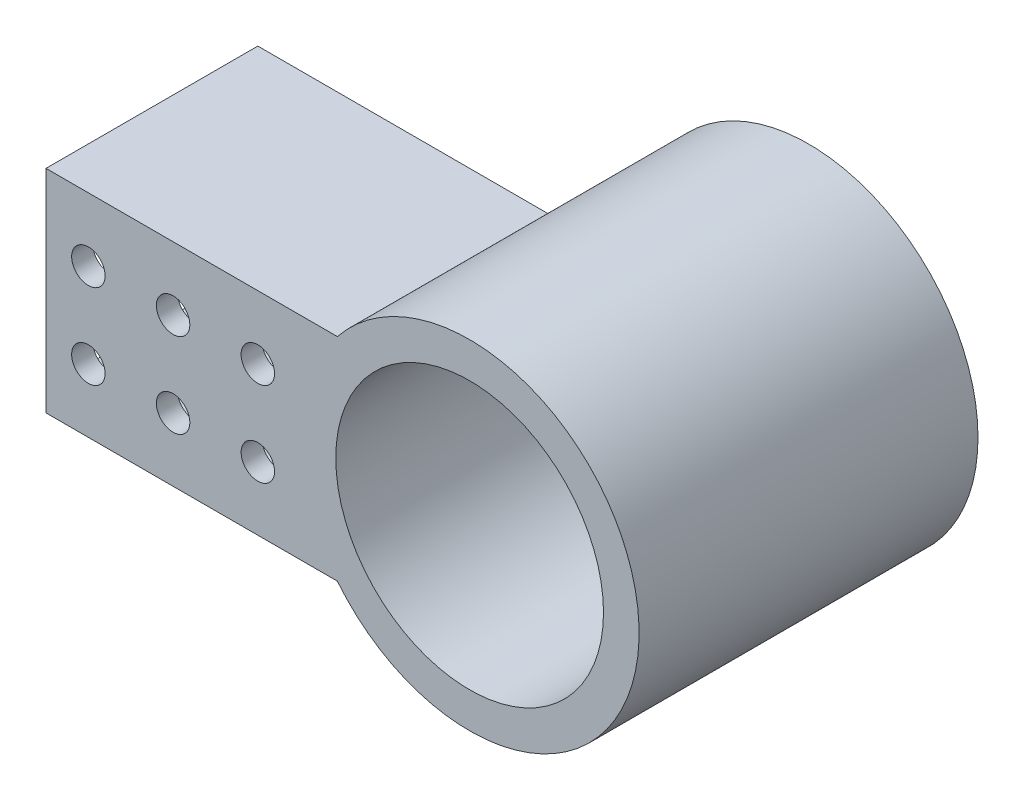
ISO-10303-21;
HEADER;
FILE_DESCRIPTION(('STEP AP214'),'2;1');
FILE_NAME('part.step','',(''),(''),'','','');
FILE_SCHEMA(('AUTOMOTIVE_DESIGN { 1 0 10303 214 1 1 1 1 }'));
ENDSEC;
DATA;
#1=APPLICATION_CONTEXT('core data for automotive mechanical design processes');
#2=APPLICATION_PROTOCOL_DEFINITION('international standard','automotive_design',2000,#1);
#3=PRODUCT_CONTEXT('',#1,'mechanical');
#4=PRODUCT('Part','Part','',(#3));
#5=PRODUCT_RELATED_PRODUCT_CATEGORY('part','',(#4));
#6=PRODUCT_DEFINITION_FORMATION('','',#4);
#7=PRODUCT_DEFINITION_CONTEXT('part definition',#1,'design');
#8=PRODUCT_DEFINITION('design','',#6,#7);
#9=PRODUCT_DEFINITION_SHAPE('','',#8);
#10=(LENGTH_UNIT() NAMED_UNIT(*) SI_UNIT(.MILLI.,.METRE.));
#11=(NAMED_UNIT(*) PLANE_ANGLE_UNIT() SI_UNIT($,.RADIAN.));
#12=(NAMED_UNIT(*) SI_UNIT($,.STERADIAN.) SOLID_ANGLE_UNIT());
#13=UNCERTAINTY_MEASURE_WITH_UNIT(LENGTH_MEASURE(1.E-05),#10,'distance_accuracy_value','');
#14=(GEOMETRIC_REPRESENTATION_CONTEXT(3) GLOBAL_UNCERTAINTY_ASSIGNED_CONTEXT((#13)) GLOBAL_UNIT_ASSIGNED_CONTEXT((#10,
#11,#12)) REPRESENTATION_CONTEXT('',''));
#15=CARTESIAN_POINT('',(0.,0.,0.));
#16=DIRECTION('',(0.,0.,1.));
#17=DIRECTION('',(1.,0.,0.));
#18=AXIS2_PLACEMENT_3D('',#15,#16,#17);
#19=CARTESIAN_POINT('',(-31.75,-6.35,19.05));
#20=DIRECTION('',(0.,0.,1.));
#21=DIRECTION('',(1.,0.,0.));
#22=AXIS2_PLACEMENT_3D('',#19,#20,#21);
#23=CYLINDRICAL_SURFACE('',#22,2.50825000000001);
#24=CARTESIAN_POINT('',(-31.75,-6.35,19.05));
#25=DIRECTION('',(0.,0.,1.));
#26=DIRECTION('',(1.,0.,0.));
#27=AXIS2_PLACEMENT_3D('',#24,#25,#26);
#28=CIRCLE('',#27,2.50825000000001);
#29=CARTESIAN_POINT('',(-29.24175,-6.35,19.05));
#30=VERTEX_POINT('',#29);
#31=EDGE_CURVE('E41',#30,#30,#28,.T.);
#32=ORIENTED_EDGE('',*,*,#31,.F.);
#33=EDGE_LOOP('',(#32));
#34=FACE_BOUND('',#33,.T.);
#35=CARTESIAN_POINT('',(-31.75,-6.35,22.225));
#36=DIRECTION('',(0.,0.,-1.));
#37=DIRECTION('',(-1.,0.,0.));
#38=AXIS2_PLACEMENT_3D('',#35,#36,#37);
#39=CIRCLE('',#38,2.50825000000001);
#40=CARTESIAN_POINT('',(-34.25825,-6.35,22.225));
#41=VERTEX_POINT('',#40);
#42=EDGE_CURVE('E11',#41,#41,#39,.T.);
#43=ORIENTED_EDGE('',*,*,#42,.F.);
#44=EDGE_LOOP('',(#43));
#45=FACE_BOUND('',#44,.T.);
#46=ADVANCED_FACE('F34',(#34,#45),#23,.F.);
#47=CARTESIAN_POINT('',(-31.75,6.35,19.05));
#48=DIRECTION('',(0.,0.,1.));
#49=DIRECTION('',(1.,0.,0.));
#50=AXIS2_PLACEMENT_3D('',#47,#48,#49);
#51=CYLINDRICAL_SURFACE('',#50,2.50825000000001);
#52=CARTESIAN_POINT('',(-31.75,6.35,50.8));
#53=DIRECTION('',(0.,0.,1.));
#54=DIRECTION('',(1.,0.,0.));
#55=AXIS2_PLACEMENT_3D('',#52,#53,#54);
#56=CIRCLE('',#55,2.50825000000001);
#57=CARTESIAN_POINT('',(-29.24175,6.35,50.8));
#58=VERTEX_POINT('',#57);
#59=EDGE_CURVE('E200',#58,#58,#56,.T.);
#60=ORIENTED_EDGE('',*,*,#59,.T.);
#61=EDGE_LOOP('',(#60));
#62=FACE_BOUND('',#61,.T.);
#63=CARTESIAN_POINT('',(-31.75,6.35,47.625));
#64=DIRECTION('',(0.,0.,1.));
#65=DIRECTION('',(0.,-1.,0.));
#66=AXIS2_PLACEMENT_3D('',#63,#64,#65);
#67=CIRCLE('',#66,2.50825000000001);
#68=CARTESIAN_POINT('',(-31.75,3.84175,47.625));
#69=VERTEX_POINT('',#68);
#70=EDGE_CURVE('E203',#69,#69,#67,.T.);
#71=ORIENTED_EDGE('',*,*,#70,.F.);
#72=EDGE_LOOP('',(#71));
#73=FACE_BOUND('',#72,.T.);
#74=ADVANCED_FACE('F212',(#62,#73),#51,.F.);
#75=CARTESIAN_POINT('',(-31.75,-6.35,19.05));
#76=DIRECTION('',(0.,0.,1.));
#77=DIRECTION('',(1.,0.,0.));
#78=AXIS2_PLACEMENT_3D('',#75,#76,#77);
#79=CYLINDRICAL_SURFACE('',#78,2.50825000000001);
#80=CARTESIAN_POINT('',(-31.75,-6.35,50.8));
#81=DIRECTION('',(0.,0.,1.));
#82=DIRECTION('',(1.,0.,0.));
#83=AXIS2_PLACEMENT_3D('',#80,#81,#82);
#84=CIRCLE('',#83,2.50825000000001);
#85=CARTESIAN_POINT('',(-29.24175,-6.35,50.8));
#86=VERTEX_POINT('',#85);
#87=EDGE_CURVE('E194',#86,#86,#84,.T.);
#88=ORIENTED_EDGE('',*,*,#87,.T.);
#89=EDGE_LOOP('',(#88));
#90=FACE_BOUND('',#89,.T.);
#91=CARTESIAN_POINT('',(-31.75,-6.35,47.625));
#92=DIRECTION('',(0.,0.,1.));
#93=DIRECTION('',(0.,-1.,0.));
#94=AXIS2_PLACEMENT_3D('',#91,#92,#93);
#95=CIRCLE('',#94,2.50825000000001);
#96=CARTESIAN_POINT('',(-31.75,-8.85825,47.625));
#97=VERTEX_POINT('',#96);
#98=EDGE_CURVE('E197',#97,#97,#95,.T.);
#99=ORIENTED_EDGE('',*,*,#98,.F.);
#100=EDGE_LOOP('',(#99));
#101=FACE_BOUND('',#100,.T.);
#102=ADVANCED_FACE('F264',(#90,#101),#79,.F.);
#103=CARTESIAN_POINT('',(-31.75,6.35,19.05));
#104=DIRECTION('',(0.,0.,1.));
#105=DIRECTION('',(1.,0.,0.));
#106=AXIS2_PLACEMENT_3D('',#103,#104,#105);
#107=CYLINDRICAL_SURFACE('',#106,2.50825000000001);
#108=CARTESIAN_POINT('',(-31.75,6.35,19.05));
#109=DIRECTION('',(0.,0.,1.));
#110=DIRECTION('',(1.,0.,0.));
#111=AXIS2_PLACEMENT_3D('',#108,#109,#110);
#112=CIRCLE('',#111,2.50825000000001);
#113=CARTESIAN_POINT('',(-29.24175,6.35,19.05));
#114=VERTEX_POINT('',#113);
#115=EDGE_CURVE('E178',#114,#114,#112,.T.);
#116=ORIENTED_EDGE('',*,*,#115,.F.);
#117=EDGE_LOOP('',(#116));
#118=FACE_BOUND('',#117,.T.);
#119=CARTESIAN_POINT('',(-31.75,6.35,22.225));
#120=DIRECTION('',(0.,0.,-1.));
#121=DIRECTION('',(-1.,0.,0.));
#122=AXIS2_PLACEMENT_3D('',#119,#120,#121);
#123=CIRCLE('',#122,2.50825000000001);
#124=CARTESIAN_POINT('',(-34.25825,6.35,22.225));
#125=VERTEX_POINT('',#124);
#126=EDGE_CURVE('E191',#125,#125,#123,.T.);
#127=ORIENTED_EDGE('',*,*,#126,.F.);
#128=EDGE_LOOP('',(#127));
#129=FACE_BOUND('',#128,.T.);
#130=ADVANCED_FACE('F254',(#118,#129),#107,.F.);
#131=CARTESIAN_POINT('',(0.,0.,50.8));
#132=DIRECTION('',(0.,0.,1.));
#133=DIRECTION('',(1.,0.,0.));
#134=AXIS2_PLACEMENT_3D('',#131,#132,#133);
#135=PLANE('',#134);
#136=CARTESIAN_POINT('',(-44.45,6.35,50.8));
#137=DIRECTION('',(0.,0.,1.));
#138=DIRECTION('',(1.,0.,0.));
#139=AXIS2_PLACEMENT_3D('',#136,#137,#138);
#140=CIRCLE('',#139,2.50825000000001);
#141=CARTESIAN_POINT('',(-41.94175,6.35,50.8));
#142=VERTEX_POINT('',#141);
#143=EDGE_CURVE('E319',#142,#142,#140,.T.);
#144=ORIENTED_EDGE('',*,*,#143,.F.);
#145=EDGE_LOOP('',(#144));
#146=FACE_BOUND('',#145,.T.);
#147=CARTESIAN_POINT('',(-44.45,-6.35,50.8));
#148=DIRECTION('',(0.,0.,1.));
#149=DIRECTION('',(1.,0.,0.));
#150=AXIS2_PLACEMENT_3D('',#147,#148,#149);
#151=CIRCLE('',#150,2.50825000000001);
#152=CARTESIAN_POINT('',(-41.94175,-6.35,50.8));
#153=VERTEX_POINT('',#152);
#154=EDGE_CURVE('E327',#153,#153,#151,.T.);
#155=ORIENTED_EDGE('',*,*,#154,.F.);
#156=EDGE_LOOP('',(#155));
#157=FACE_BOUND('',#156,.T.);
#158=CARTESIAN_POINT('',(-57.15,6.35,50.8));
#159=DIRECTION('',(0.,0.,1.));
#160=DIRECTION('',(1.,0.,0.));
#161=AXIS2_PLACEMENT_3D('',#158,#159,#160);
#162=CIRCLE('',#161,2.50825000000001);
#163=CARTESIAN_POINT('',(-54.64175,6.35,50.8));
#164=VERTEX_POINT('',#163);
#165=EDGE_CURVE('E342',#164,#164,#162,.T.);
#166=ORIENTED_EDGE('',*,*,#165,.F.);
#167=EDGE_LOOP('',(#166));
#168=FACE_BOUND('',#167,.T.);
#169=CARTESIAN_POINT('',(-57.15,-6.35,50.8));
#170=DIRECTION('',(0.,0.,1.));
#171=DIRECTION('',(1.,0.,0.));
#172=AXIS2_PLACEMENT_3D('',#169,#170,#171);
#173=CIRCLE('',#172,2.50825000000001);
#174=CARTESIAN_POINT('',(-54.64175,-6.35,50.8));
#175=VERTEX_POINT('',#174);
#176=EDGE_CURVE('E339',#175,#175,#173,.T.);
#177=ORIENTED_EDGE('',*,*,#176,.F.);
#178=EDGE_LOOP('',(#177));
#179=FACE_BOUND('',#178,.T.);
#180=CARTESIAN_POINT('',(0.,0.,50.8));
#181=DIRECTION('',(0.,0.,1.));
#182=DIRECTION('',(1.,0.,0.));
#183=AXIS2_PLACEMENT_3D('',#180,#181,#182);
#184=CIRCLE('',#183,25.4);
#185=CARTESIAN_POINT('',(-19.8278686449149,-15.875,50.8));
#186=VERTEX_POINT('',#185);
#187=CARTESIAN_POINT('',(-19.8278686449149,15.875,50.8));
#188=VERTEX_POINT('',#187);
#189=EDGE_CURVE('E176',#186,#188,#184,.T.);
#190=ORIENTED_EDGE('',*,*,#189,.T.);
#191=DIRECTION('',(-1.,0.,0.));
#192=VECTOR('',#191,1.);
#193=CARTESIAN_POINT('',(-19.8278686449149,15.875,50.8));
#194=LINE('',#193,#192);
#195=CARTESIAN_POINT('',(-63.5,15.875,50.8));
#196=VERTEX_POINT('',#195);
#197=EDGE_CURVE('E139',#188,#196,#194,.T.);
#198=ORIENTED_EDGE('',*,*,#197,.T.);
#199=DIRECTION('',(0.,-1.,0.));
#200=VECTOR('',#199,1.);
#201=CARTESIAN_POINT('',(-63.5,15.875,50.8));
#202=LINE('',#201,#200);
#203=CARTESIAN_POINT('',(-63.5,-15.875,50.8));
#204=VERTEX_POINT('',#203);
#205=EDGE_CURVE('E158',#196,#204,#202,.T.);
#206=ORIENTED_EDGE('',*,*,#205,.T.);
#207=DIRECTION('',(1.,0.,0.));
#208=VECTOR('',#207,1.);
#209=CARTESIAN_POINT('',(-19.8278686449149,-15.875,50.8));
#210=LINE('',#209,#208);
#211=EDGE_CURVE('E56',#204,#186,#210,.T.);
#212=ORIENTED_EDGE('',*,*,#211,.T.);
#213=EDGE_LOOP('',(#190,#198,#206,#212));
#214=FACE_BOUND('',#213,.T.);
#215=CARTESIAN_POINT('',(0.,0.,50.8));
#216=DIRECTION('',(0.,0.,1.));
#217=DIRECTION('',(1.,0.,0.));
#218=AXIS2_PLACEMENT_3D('',#215,#216,#217);
#219=CIRCLE('',#218,20.066);
#220=CARTESIAN_POINT('',(20.066,0.,50.8));
#221=VERTEX_POINT('',#220);
#222=EDGE_CURVE('E170',#221,#221,#219,.T.);
#223=ORIENTED_EDGE('',*,*,#222,.F.);
#224=EDGE_LOOP('',(#223));
#225=FACE_BOUND('',#224,.T.);
#226=ORIENTED_EDGE('',*,*,#87,.F.);
#227=EDGE_LOOP('',(#226));
#228=FACE_BOUND('',#227,.T.);
#229=ORIENTED_EDGE('',*,*,#59,.F.);
#230=EDGE_LOOP('',(#229));
#231=FACE_BOUND('',#230,.T.);
#232=ADVANCED_FACE('F250',(#146,#157,#168,#179,#214,#225,#228,#231),#135,.T.);
#233=CARTESIAN_POINT('',(0.,0.,0.));
#234=DIRECTION('',(0.,0.,1.));
#235=DIRECTION('',(1.,0.,0.));
#236=AXIS2_PLACEMENT_3D('',#233,#234,#235);
#237=PLANE('',#236);
#238=CARTESIAN_POINT('',(0.,0.,0.));
#239=DIRECTION('',(0.,0.,1.));
#240=DIRECTION('',(1.,0.,0.));
#241=AXIS2_PLACEMENT_3D('',#238,#239,#240);
#242=CIRCLE('',#241,25.4);
#243=CARTESIAN_POINT('',(25.4,0.,0.));
#244=VERTEX_POINT('',#243);
#245=EDGE_CURVE('E173',#244,#244,#242,.T.);
#246=ORIENTED_EDGE('',*,*,#245,.F.);
#247=EDGE_LOOP('',(#246));
#248=FACE_BOUND('',#247,.T.);
#249=CARTESIAN_POINT('',(0.,0.,0.));
#250=DIRECTION('',(0.,0.,1.));
#251=DIRECTION('',(1.,0.,0.));
#252=AXIS2_PLACEMENT_3D('',#249,#250,#251);
#253=CIRCLE('',#252,20.066);
#254=CARTESIAN_POINT('',(20.066,0.,0.));
#255=VERTEX_POINT('',#254);
#256=EDGE_CURVE('E163',#255,#255,#253,.T.);
#257=ORIENTED_EDGE('',*,*,#256,.T.);
#258=EDGE_LOOP('',(#257));
#259=FACE_BOUND('',#258,.T.);
#260=ADVANCED_FACE('F253',(#248,#259),#237,.F.);
#261=CARTESIAN_POINT('',(0.,0.,50.8));
#262=DIRECTION('',(0.,0.,-1.));
#263=DIRECTION('',(-1.,0.,0.));
#264=AXIS2_PLACEMENT_3D('',#261,#262,#263);
#265=CYLINDRICAL_SURFACE('',#264,25.4);
#266=ORIENTED_EDGE('',*,*,#189,.F.);
#267=DIRECTION('',(0.,0.,1.));
#268=VECTOR('',#267,1.);
#269=CARTESIAN_POINT('',(-19.8278686449149,-15.875,19.05));
#270=LINE('',#269,#268);
#271=CARTESIAN_POINT('',(-19.8278686449149,-15.875,19.05));
#272=VERTEX_POINT('',#271);
#273=EDGE_CURVE('E161',#272,#186,#270,.T.);
#274=ORIENTED_EDGE('',*,*,#273,.F.);
#275=CARTESIAN_POINT('',(0.,0.,19.05));
#276=DIRECTION('',(0.,0.,-1.));
#277=DIRECTION('',(1.,0.,0.));
#278=AXIS2_PLACEMENT_3D('',#275,#276,#277);
#279=CIRCLE('',#278,25.4);
#280=CARTESIAN_POINT('',(-19.8278686449149,15.875,19.05));
#281=VERTEX_POINT('',#280);
#282=EDGE_CURVE('E143',#272,#281,#279,.T.);
#283=ORIENTED_EDGE('',*,*,#282,.T.);
#284=DIRECTION('',(0.,0.,1.));
#285=VECTOR('',#284,1.);
#286=CARTESIAN_POINT('',(-19.8278686449149,15.875,19.05));
#287=LINE('',#286,#285);
#288=EDGE_CURVE('E155',#281,#188,#287,.T.);
#289=ORIENTED_EDGE('',*,*,#288,.T.);
#290=EDGE_LOOP('',(#266,#274,#283,#289));
#291=FACE_BOUND('',#290,.T.);
#292=ORIENTED_EDGE('',*,*,#245,.T.);
#293=EDGE_LOOP('',(#292));
#294=FACE_BOUND('',#293,.T.);
#295=ADVANCED_FACE('F248',(#291,#294),#265,.T.);
#296=CARTESIAN_POINT('',(0.,0.,50.8));
#297=DIRECTION('',(0.,0.,-1.));
#298=DIRECTION('',(-1.,0.,0.));
#299=AXIS2_PLACEMENT_3D('',#296,#297,#298);
#300=CYLINDRICAL_SURFACE('',#299,20.066);
#301=ORIENTED_EDGE('',*,*,#222,.T.);
#302=EDGE_LOOP('',(#301));
#303=FACE_BOUND('',#302,.T.);
#304=ORIENTED_EDGE('',*,*,#256,.F.);
#305=EDGE_LOOP('',(#304));
#306=FACE_BOUND('',#305,.T.);
#307=ADVANCED_FACE('F238',(#303,#306),#300,.F.);
#308=CARTESIAN_POINT('',(-19.8278686449149,-15.875,19.05));
#309=DIRECTION('',(0.,-1.,0.));
#310=DIRECTION('',(1.,0.,0.));
#311=AXIS2_PLACEMENT_3D('',#308,#309,#310);
#312=PLANE('',#311);
#313=ORIENTED_EDGE('',*,*,#211,.F.);
#314=DIRECTION('',(0.,0.,1.));
#315=VECTOR('',#314,1.);
#316=CARTESIAN_POINT('',(-63.5,-15.875,19.05));
#317=LINE('',#316,#315);
#318=CARTESIAN_POINT('',(-63.5,-15.875,19.05));
#319=VERTEX_POINT('',#318);
#320=EDGE_CURVE('E164',#319,#204,#317,.T.);
#321=ORIENTED_EDGE('',*,*,#320,.F.);
#322=DIRECTION('',(1.,0.,0.));
#323=VECTOR('',#322,1.);
#324=CARTESIAN_POINT('',(-19.8278686449149,-15.875,19.05));
#325=LINE('',#324,#323);
#326=EDGE_CURVE('E152',#319,#272,#325,.T.);
#327=ORIENTED_EDGE('',*,*,#326,.T.);
#328=ORIENTED_EDGE('',*,*,#273,.T.);
#329=EDGE_LOOP('',(#313,#321,#327,#328));
#330=FACE_BOUND('',#329,.T.);
#331=ADVANCED_FACE('F234',(#330),#312,.T.);
#332=CARTESIAN_POINT('',(-63.5,15.875,19.05));
#333=DIRECTION('',(-1.,0.,0.));
#334=DIRECTION('',(0.,0.,1.));
#335=AXIS2_PLACEMENT_3D('',#332,#333,#334);
#336=PLANE('',#335);
#337=DIRECTION('',(0.,-1.,0.));
#338=VECTOR('',#337,1.);
#339=CARTESIAN_POINT('',(-63.5,12.7,22.225));
#340=LINE('',#339,#338);
#341=CARTESIAN_POINT('',(-63.5,12.7,22.225));
#342=VERTEX_POINT('',#341);
#343=CARTESIAN_POINT('',(-63.5,-12.7,22.225));
#344=VERTEX_POINT('',#343);
#345=EDGE_CURVE('E48',#342,#344,#340,.T.);
#346=ORIENTED_EDGE('',*,*,#345,.F.);
#347=DIRECTION('',(0.,0.,-1.));
#348=VECTOR('',#347,1.);
#349=CARTESIAN_POINT('',(-63.5,12.7,22.225));
#350=LINE('',#349,#348);
#351=CARTESIAN_POINT('',(-63.5,12.7,47.625));
#352=VERTEX_POINT('',#351);
#353=EDGE_CURVE('E121',#352,#342,#350,.T.);
#354=ORIENTED_EDGE('',*,*,#353,.F.);
#355=DIRECTION('',(0.,1.,0.));
#356=VECTOR('',#355,1.);
#357=CARTESIAN_POINT('',(-63.5,12.7,47.625));
#358=LINE('',#357,#356);
#359=CARTESIAN_POINT('',(-63.5,-12.7,47.625));
#360=VERTEX_POINT('',#359);
#361=EDGE_CURVE('E124',#360,#352,#358,.T.);
#362=ORIENTED_EDGE('',*,*,#361,.F.);
#363=DIRECTION('',(0.,0.,1.));
#364=VECTOR('',#363,1.);
#365=CARTESIAN_POINT('',(-63.5,-12.7,22.225));
#366=LINE('',#365,#364);
#367=EDGE_CURVE('E133',#344,#360,#366,.T.);
#368=ORIENTED_EDGE('',*,*,#367,.F.);
#369=EDGE_LOOP('',(#346,#354,#362,#368));
#370=FACE_BOUND('',#369,.T.);
#371=ORIENTED_EDGE('',*,*,#205,.F.);
#372=DIRECTION('',(0.,0.,1.));
#373=VECTOR('',#372,1.);
#374=CARTESIAN_POINT('',(-63.5,15.875,19.05));
#375=LINE('',#374,#373);
#376=CARTESIAN_POINT('',(-63.5,15.875,19.05));
#377=VERTEX_POINT('',#376);
#378=EDGE_CURVE('E166',#377,#196,#375,.T.);
#379=ORIENTED_EDGE('',*,*,#378,.F.);
#380=DIRECTION('',(0.,-1.,0.));
#381=VECTOR('',#380,1.);
#382=CARTESIAN_POINT('',(-63.5,15.875,19.05));
#383=LINE('',#382,#381);
#384=EDGE_CURVE('E149',#377,#319,#383,.T.);
#385=ORIENTED_EDGE('',*,*,#384,.T.);
#386=ORIENTED_EDGE('',*,*,#320,.T.);
#387=EDGE_LOOP('',(#371,#379,#385,#386));
#388=FACE_BOUND('',#387,.T.);
#389=ADVANCED_FACE('F237',(#370,#388),#336,.T.);
#390=CARTESIAN_POINT('',(-19.8278686449149,15.875,19.05));
#391=DIRECTION('',(0.,1.,0.));
#392=DIRECTION('',(-1.,0.,0.));
#393=AXIS2_PLACEMENT_3D('',#390,#391,#392);
#394=PLANE('',#393);
#395=ORIENTED_EDGE('',*,*,#197,.F.);
#396=ORIENTED_EDGE('',*,*,#288,.F.);
#397=DIRECTION('',(-1.,0.,0.));
#398=VECTOR('',#397,1.);
#399=CARTESIAN_POINT('',(-19.8278686449149,15.875,19.05));
#400=LINE('',#399,#398);
#401=EDGE_CURVE('E146',#281,#377,#400,.T.);
#402=ORIENTED_EDGE('',*,*,#401,.T.);
#403=ORIENTED_EDGE('',*,*,#378,.T.);
#404=EDGE_LOOP('',(#395,#396,#402,#403));
#405=FACE_BOUND('',#404,.T.);
#406=ADVANCED_FACE('F226',(#405),#394,.T.);
#407=CARTESIAN_POINT('',(0.,0.,19.05));
#408=DIRECTION('',(0.,0.,1.));
#409=DIRECTION('',(1.,0.,0.));
#410=AXIS2_PLACEMENT_3D('',#407,#408,#409);
#411=PLANE('',#410);
#412=CARTESIAN_POINT('',(-44.45,-6.35,19.05));
#413=DIRECTION('',(0.,0.,1.));
#414=DIRECTION('',(1.,0.,0.));
#415=AXIS2_PLACEMENT_3D('',#412,#413,#414);
#416=CIRCLE('',#415,2.50825000000001);
#417=CARTESIAN_POINT('',(-41.94175,-6.35,19.05));
#418=VERTEX_POINT('',#417);
#419=EDGE_CURVE('E316',#418,#418,#416,.T.);
#420=ORIENTED_EDGE('',*,*,#419,.T.);
#421=EDGE_LOOP('',(#420));
#422=FACE_BOUND('',#421,.T.);
#423=CARTESIAN_POINT('',(-44.45,6.35,19.05));
#424=DIRECTION('',(0.,0.,1.));
#425=DIRECTION('',(1.,0.,0.));
#426=AXIS2_PLACEMENT_3D('',#423,#424,#425);
#427=CIRCLE('',#426,2.50825000000001);
#428=CARTESIAN_POINT('',(-41.94175,6.35,19.05));
#429=VERTEX_POINT('',#428);
#430=EDGE_CURVE('E333',#429,#429,#427,.T.);
#431=ORIENTED_EDGE('',*,*,#430,.T.);
#432=EDGE_LOOP('',(#431));
#433=FACE_BOUND('',#432,.T.);
#434=CARTESIAN_POINT('',(-57.15,6.35,19.05));
#435=DIRECTION('',(0.,0.,1.));
#436=DIRECTION('',(1.,0.,0.));
#437=AXIS2_PLACEMENT_3D('',#434,#435,#436);
#438=CIRCLE('',#437,2.50825000000001);
#439=CARTESIAN_POINT('',(-54.64175,6.35,19.05));
#440=VERTEX_POINT('',#439);
#441=EDGE_CURVE('E185',#440,#440,#438,.T.);
#442=ORIENTED_EDGE('',*,*,#441,.T.);
#443=EDGE_LOOP('',(#442));
#444=FACE_BOUND('',#443,.T.);
#445=CARTESIAN_POINT('',(-57.15,-6.35,19.05));
#446=DIRECTION('',(0.,0.,1.));
#447=DIRECTION('',(1.,0.,0.));
#448=AXIS2_PLACEMENT_3D('',#445,#446,#447);
#449=CIRCLE('',#448,2.50825000000001);
#450=CARTESIAN_POINT('',(-54.64175,-6.35,19.05));
#451=VERTEX_POINT('',#450);
#452=EDGE_CURVE('E345',#451,#451,#449,.T.);
#453=ORIENTED_EDGE('',*,*,#452,.T.);
#454=EDGE_LOOP('',(#453));
#455=FACE_BOUND('',#454,.T.);
#456=ORIENTED_EDGE('',*,*,#282,.F.);
#457=ORIENTED_EDGE('',*,*,#326,.F.);
#458=ORIENTED_EDGE('',*,*,#384,.F.);
#459=ORIENTED_EDGE('',*,*,#401,.F.);
#460=EDGE_LOOP('',(#456,#457,#458,#459));
#461=FACE_BOUND('',#460,.T.);
#462=ORIENTED_EDGE('',*,*,#115,.T.);
#463=EDGE_LOOP('',(#462));
#464=FACE_BOUND('',#463,.T.);
#465=ORIENTED_EDGE('',*,*,#31,.T.);
#466=EDGE_LOOP('',(#465));
#467=FACE_BOUND('',#466,.T.);
#468=ADVANCED_FACE('F208',(#422,#433,#444,#455,#461,#464,#467),#411,.F.);
#469=CARTESIAN_POINT('',(-25.4,12.7,22.225));
#470=DIRECTION('',(0.,0.,-1.));
#471=DIRECTION('',(-1.,0.,0.));
#472=AXIS2_PLACEMENT_3D('',#469,#470,#471);
#473=PLANE('',#472);
#474=CARTESIAN_POINT('',(-44.45,-6.35,22.225));
#475=DIRECTION('',(0.,0.,-1.));
#476=DIRECTION('',(-1.,0.,0.));
#477=AXIS2_PLACEMENT_3D('',#474,#475,#476);
#478=CIRCLE('',#477,2.50825000000001);
#479=CARTESIAN_POINT('',(-46.95825,-6.35,22.225));
#480=VERTEX_POINT('',#479);
#481=EDGE_CURVE('E318',#480,#480,#478,.T.);
#482=ORIENTED_EDGE('',*,*,#481,.T.);
#483=EDGE_LOOP('',(#482));
#484=FACE_BOUND('',#483,.T.);
#485=CARTESIAN_POINT('',(-44.45,6.35,22.225));
#486=DIRECTION('',(0.,0.,-1.));
#487=DIRECTION('',(-1.,0.,0.));
#488=AXIS2_PLACEMENT_3D('',#485,#486,#487);
#489=CIRCLE('',#488,2.50825000000001);
#490=CARTESIAN_POINT('',(-46.95825,6.35,22.225));
#491=VERTEX_POINT('',#490);
#492=EDGE_CURVE('E336',#491,#491,#489,.T.);
#493=ORIENTED_EDGE('',*,*,#492,.T.);
#494=EDGE_LOOP('',(#493));
#495=FACE_BOUND('',#494,.T.);
#496=CARTESIAN_POINT('',(-57.15,6.35,22.225));
#497=DIRECTION('',(0.,0.,-1.));
#498=DIRECTION('',(-1.,0.,0.));
#499=AXIS2_PLACEMENT_3D('',#496,#497,#498);
#500=CIRCLE('',#499,2.50825000000001);
#501=CARTESIAN_POINT('',(-59.65825,6.35,22.225));
#502=VERTEX_POINT('',#501);
#503=EDGE_CURVE('E127',#502,#502,#500,.T.);
#504=ORIENTED_EDGE('',*,*,#503,.T.);
#505=EDGE_LOOP('',(#504));
#506=FACE_BOUND('',#505,.T.);
#507=CARTESIAN_POINT('',(-57.15,-6.35,22.225));
#508=DIRECTION('',(0.,0.,-1.));
#509=DIRECTION('',(-1.,0.,0.));
#510=AXIS2_PLACEMENT_3D('',#507,#508,#509);
#511=CIRCLE('',#510,2.50825000000001);
#512=CARTESIAN_POINT('',(-59.65825,-6.35,22.225));
#513=VERTEX_POINT('',#512);
#514=EDGE_CURVE('E184',#513,#513,#511,.T.);
#515=ORIENTED_EDGE('',*,*,#514,.T.);
#516=EDGE_LOOP('',(#515));
#517=FACE_BOUND('',#516,.T.);
#518=ORIENTED_EDGE('',*,*,#345,.T.);
#519=DIRECTION('',(-1.,0.,0.));
#520=VECTOR('',#519,1.);
#521=CARTESIAN_POINT('',(-25.4,-12.7,22.225));
#522=LINE('',#521,#520);
#523=CARTESIAN_POINT('',(-25.4,-12.7,22.225));
#524=VERTEX_POINT('',#523);
#525=EDGE_CURVE('E98',#524,#344,#522,.T.);
#526=ORIENTED_EDGE('',*,*,#525,.F.);
#527=DIRECTION('',(0.,-1.,0.));
#528=VECTOR('',#527,1.);
#529=CARTESIAN_POINT('',(-25.4,12.7,22.225));
#530=LINE('',#529,#528);
#531=CARTESIAN_POINT('',(-25.4,12.7,22.225));
#532=VERTEX_POINT('',#531);
#533=EDGE_CURVE('E103',#532,#524,#530,.T.);
#534=ORIENTED_EDGE('',*,*,#533,.F.);
#535=DIRECTION('',(-1.,0.,0.));
#536=VECTOR('',#535,1.);
#537=CARTESIAN_POINT('',(-25.4,12.7,22.225));
#538=LINE('',#537,#536);
#539=EDGE_CURVE('E137',#532,#342,#538,.T.);
#540=ORIENTED_EDGE('',*,*,#539,.T.);
#541=EDGE_LOOP('',(#518,#526,#534,#540));
#542=FACE_BOUND('',#541,.T.);
#543=ORIENTED_EDGE('',*,*,#126,.T.);
#544=EDGE_LOOP('',(#543));
#545=FACE_BOUND('',#544,.T.);
#546=ORIENTED_EDGE('',*,*,#42,.T.);
#547=EDGE_LOOP('',(#546));
#548=FACE_BOUND('',#547,.T.);
#549=ADVANCED_FACE('F100',(#484,#495,#506,#517,#542,#545,#548),#473,.F.);
#550=CARTESIAN_POINT('',(-25.4,12.7,22.225));
#551=DIRECTION('',(0.,1.,0.));
#552=DIRECTION('',(0.,0.,1.));
#553=AXIS2_PLACEMENT_3D('',#550,#551,#552);
#554=PLANE('',#553);
#555=ORIENTED_EDGE('',*,*,#353,.T.);
#556=ORIENTED_EDGE('',*,*,#539,.F.);
#557=DIRECTION('',(0.,0.,-1.));
#558=VECTOR('',#557,1.);
#559=CARTESIAN_POINT('',(-25.4,12.7,22.225));
#560=LINE('',#559,#558);
#561=CARTESIAN_POINT('',(-25.4,12.7,47.625));
#562=VERTEX_POINT('',#561);
#563=EDGE_CURVE('E109',#562,#532,#560,.T.);
#564=ORIENTED_EDGE('',*,*,#563,.F.);
#565=DIRECTION('',(-1.,0.,0.));
#566=VECTOR('',#565,1.);
#567=CARTESIAN_POINT('',(-25.4,12.7,47.625));
#568=LINE('',#567,#566);
#569=EDGE_CURVE('E140',#562,#352,#568,.T.);
#570=ORIENTED_EDGE('',*,*,#569,.T.);
#571=EDGE_LOOP('',(#555,#556,#564,#570));
#572=FACE_BOUND('',#571,.T.);
#573=ADVANCED_FACE('F216',(#572),#554,.F.);
#574=CARTESIAN_POINT('',(-25.4,12.7,47.625));
#575=DIRECTION('',(0.,0.,1.));
#576=DIRECTION('',(0.,-1.,0.));
#577=AXIS2_PLACEMENT_3D('',#574,#575,#576);
#578=PLANE('',#577);
#579=CARTESIAN_POINT('',(-44.45,6.35,47.625));
#580=DIRECTION('',(0.,0.,1.));
#581=DIRECTION('',(0.,-1.,0.));
#582=AXIS2_PLACEMENT_3D('',#579,#580,#581);
#583=CIRCLE('',#582,2.50825000000001);
#584=CARTESIAN_POINT('',(-44.45,3.84175,47.625));
#585=VERTEX_POINT('',#584);
#586=EDGE_CURVE('E322',#585,#585,#583,.T.);
#587=ORIENTED_EDGE('',*,*,#586,.T.);
#588=EDGE_LOOP('',(#587));
#589=FACE_BOUND('',#588,.T.);
#590=CARTESIAN_POINT('',(-44.45,-6.35,47.625));
#591=DIRECTION('',(0.,0.,1.));
#592=DIRECTION('',(0.,-1.,0.));
#593=AXIS2_PLACEMENT_3D('',#590,#591,#592);
#594=CIRCLE('',#593,2.50825000000001);
#595=CARTESIAN_POINT('',(-44.45,-8.85825,47.625));
#596=VERTEX_POINT('',#595);
#597=EDGE_CURVE('E330',#596,#596,#594,.T.);
#598=ORIENTED_EDGE('',*,*,#597,.T.);
#599=EDGE_LOOP('',(#598));
#600=FACE_BOUND('',#599,.T.);
#601=CARTESIAN_POINT('',(-57.15,6.35,47.625));
#602=DIRECTION('',(0.,0.,1.));
#603=DIRECTION('',(0.,-1.,0.));
#604=AXIS2_PLACEMENT_3D('',#601,#602,#603);
#605=CIRCLE('',#604,2.50825000000001);
#606=CARTESIAN_POINT('',(-57.15,3.84174999999999,47.625));
#607=VERTEX_POINT('',#606);
#608=EDGE_CURVE('E186',#607,#607,#605,.T.);
#609=ORIENTED_EDGE('',*,*,#608,.T.);
#610=EDGE_LOOP('',(#609));
#611=FACE_BOUND('',#610,.T.);
#612=CARTESIAN_POINT('',(-57.15,-6.35,47.625));
#613=DIRECTION('',(0.,0.,1.));
#614=DIRECTION('',(0.,-1.,0.));
#615=AXIS2_PLACEMENT_3D('',#612,#613,#614);
#616=CIRCLE('',#615,2.50825000000001);
#617=CARTESIAN_POINT('',(-57.15,-8.85825000000001,47.625));
#618=VERTEX_POINT('',#617);
#619=EDGE_CURVE('E181',#618,#618,#616,.T.);
#620=ORIENTED_EDGE('',*,*,#619,.T.);
#621=EDGE_LOOP('',(#620));
#622=FACE_BOUND('',#621,.T.);
#623=ORIENTED_EDGE('',*,*,#361,.T.);
#624=ORIENTED_EDGE('',*,*,#569,.F.);
#625=DIRECTION('',(0.,1.,0.));
#626=VECTOR('',#625,1.);
#627=CARTESIAN_POINT('',(-25.4,12.7,47.625));
#628=LINE('',#627,#626);
#629=CARTESIAN_POINT('',(-25.4,-12.7,47.625));
#630=VERTEX_POINT('',#629);
#631=EDGE_CURVE('E117',#630,#562,#628,.T.);
#632=ORIENTED_EDGE('',*,*,#631,.F.);
#633=DIRECTION('',(-1.,0.,0.));
#634=VECTOR('',#633,1.);
#635=CARTESIAN_POINT('',(-25.4,-12.7,47.625));
#636=LINE('',#635,#634);
#637=EDGE_CURVE('E108',#630,#360,#636,.T.);
#638=ORIENTED_EDGE('',*,*,#637,.T.);
#639=EDGE_LOOP('',(#623,#624,#632,#638));
#640=FACE_BOUND('',#639,.T.);
#641=ORIENTED_EDGE('',*,*,#98,.T.);
#642=EDGE_LOOP('',(#641));
#643=FACE_BOUND('',#642,.T.);
#644=ORIENTED_EDGE('',*,*,#70,.T.);
#645=EDGE_LOOP('',(#644));
#646=FACE_BOUND('',#645,.T.);
#647=ADVANCED_FACE('F223',(#589,#600,#611,#622,#640,#643,#646),#578,.F.);
#648=CARTESIAN_POINT('',(-25.4,-12.7,22.225));
#649=DIRECTION('',(0.,-1.,0.));
#650=DIRECTION('',(0.,0.,-1.));
#651=AXIS2_PLACEMENT_3D('',#648,#649,#650);
#652=PLANE('',#651);
#653=ORIENTED_EDGE('',*,*,#367,.T.);
#654=ORIENTED_EDGE('',*,*,#637,.F.);
#655=DIRECTION('',(0.,0.,1.));
#656=VECTOR('',#655,1.);
#657=CARTESIAN_POINT('',(-25.4,-12.7,22.225));
#658=LINE('',#657,#656);
#659=EDGE_CURVE('E112',#524,#630,#658,.T.);
#660=ORIENTED_EDGE('',*,*,#659,.F.);
#661=ORIENTED_EDGE('',*,*,#525,.T.);
#662=EDGE_LOOP('',(#653,#654,#660,#661));
#663=FACE_BOUND('',#662,.T.);
#664=ADVANCED_FACE('F113',(#663),#652,.F.);
#665=CARTESIAN_POINT('',(-25.4,0.,0.));
#666=DIRECTION('',(-1.,0.,0.));
#667=DIRECTION('',(0.,0.,1.));
#668=AXIS2_PLACEMENT_3D('',#665,#666,#667);
#669=PLANE('',#668);
#670=ORIENTED_EDGE('',*,*,#533,.T.);
#671=ORIENTED_EDGE('',*,*,#659,.T.);
#672=ORIENTED_EDGE('',*,*,#631,.T.);
#673=ORIENTED_EDGE('',*,*,#563,.T.);
#674=EDGE_LOOP('',(#670,#671,#672,#673));
#675=FACE_BOUND('',#674,.T.);
#676=ADVANCED_FACE('F119',(#675),#669,.T.);
#677=CARTESIAN_POINT('',(-57.15,-6.35,19.05));
#678=DIRECTION('',(0.,0.,1.));
#679=DIRECTION('',(1.,0.,0.));
#680=AXIS2_PLACEMENT_3D('',#677,#678,#679);
#681=CYLINDRICAL_SURFACE('',#680,2.50825000000001);
#682=ORIENTED_EDGE('',*,*,#176,.T.);
#683=EDGE_LOOP('',(#682));
#684=FACE_BOUND('',#683,.T.);
#685=ORIENTED_EDGE('',*,*,#619,.F.);
#686=EDGE_LOOP('',(#685));
#687=FACE_BOUND('',#686,.T.);
#688=ADVANCED_FACE('F286',(#684,#687),#681,.F.);
#689=CARTESIAN_POINT('',(-57.15,6.35,19.05));
#690=DIRECTION('',(0.,0.,1.));
#691=DIRECTION('',(1.,0.,0.));
#692=AXIS2_PLACEMENT_3D('',#689,#690,#691);
#693=CYLINDRICAL_SURFACE('',#692,2.50825000000001);
#694=ORIENTED_EDGE('',*,*,#165,.T.);
#695=EDGE_LOOP('',(#694));
#696=FACE_BOUND('',#695,.T.);
#697=ORIENTED_EDGE('',*,*,#608,.F.);
#698=EDGE_LOOP('',(#697));
#699=FACE_BOUND('',#698,.T.);
#700=ADVANCED_FACE('F291',(#696,#699),#693,.F.);
#701=ORIENTED_EDGE('',*,*,#452,.F.);
#702=EDGE_LOOP('',(#701));
#703=FACE_BOUND('',#702,.T.);
#704=ORIENTED_EDGE('',*,*,#514,.F.);
#705=EDGE_LOOP('',(#704));
#706=FACE_BOUND('',#705,.T.);
#707=ADVANCED_FACE('F287',(#703,#706),#681,.F.);
#708=ORIENTED_EDGE('',*,*,#441,.F.);
#709=EDGE_LOOP('',(#708));
#710=FACE_BOUND('',#709,.T.);
#711=ORIENTED_EDGE('',*,*,#503,.F.);
#712=EDGE_LOOP('',(#711));
#713=FACE_BOUND('',#712,.T.);
#714=ADVANCED_FACE('F290',(#710,#713),#693,.F.);
#715=CARTESIAN_POINT('',(-44.45,6.35,19.05));
#716=DIRECTION('',(0.,0.,1.));
#717=DIRECTION('',(1.,0.,0.));
#718=AXIS2_PLACEMENT_3D('',#715,#716,#717);
#719=CYLINDRICAL_SURFACE('',#718,2.50825000000001);
#720=ORIENTED_EDGE('',*,*,#430,.F.);
#721=EDGE_LOOP('',(#720));
#722=FACE_BOUND('',#721,.T.);
#723=ORIENTED_EDGE('',*,*,#492,.F.);
#724=EDGE_LOOP('',(#723));
#725=FACE_BOUND('',#724,.T.);
#726=ADVANCED_FACE('F295',(#722,#725),#719,.F.);
#727=CARTESIAN_POINT('',(-44.45,-6.35,19.05));
#728=DIRECTION('',(0.,0.,1.));
#729=DIRECTION('',(1.,0.,0.));
#730=AXIS2_PLACEMENT_3D('',#727,#728,#729);
#731=CYLINDRICAL_SURFACE('',#730,2.50825000000001);
#732=ORIENTED_EDGE('',*,*,#154,.T.);
#733=EDGE_LOOP('',(#732));
#734=FACE_BOUND('',#733,.T.);
#735=ORIENTED_EDGE('',*,*,#597,.F.);
#736=EDGE_LOOP('',(#735));
#737=FACE_BOUND('',#736,.T.);
#738=ADVANCED_FACE('F299',(#734,#737),#731,.F.);
#739=CARTESIAN_POINT('',(-44.45,6.35,19.05));
#740=DIRECTION('',(0.,0.,1.));
#741=DIRECTION('',(1.,0.,0.));
#742=AXIS2_PLACEMENT_3D('',#739,#740,#741);
#743=CYLINDRICAL_SURFACE('',#742,2.50825000000001);
#744=ORIENTED_EDGE('',*,*,#143,.T.);
#745=EDGE_LOOP('',(#744));
#746=FACE_BOUND('',#745,.T.);
#747=ORIENTED_EDGE('',*,*,#586,.F.);
#748=EDGE_LOOP('',(#747));
#749=FACE_BOUND('',#748,.T.);
#750=ADVANCED_FACE('F303',(#746,#749),#743,.F.);
#751=CARTESIAN_POINT('',(-44.45,-6.35,19.05));
#752=DIRECTION('',(0.,0.,1.));
#753=DIRECTION('',(1.,0.,0.));
#754=AXIS2_PLACEMENT_3D('',#751,#752,#753);
#755=CYLINDRICAL_SURFACE('',#754,2.50825000000001);
#756=ORIENTED_EDGE('',*,*,#419,.F.);
#757=EDGE_LOOP('',(#756));
#758=FACE_BOUND('',#757,.T.);
#759=ORIENTED_EDGE('',*,*,#481,.F.);
#760=EDGE_LOOP('',(#759));
#761=FACE_BOUND('',#760,.T.);
#762=ADVANCED_FACE('F307',(#758,#761),#755,.F.);
#763=CLOSED_SHELL('',(#46,#74,#102,#130,#232,#260,#295,#307,#331,#389,#406,#468,#549,#573,#647,
#664,#676,#688,#700,#707,#714,#726,#738,#750,#762));
#764=MANIFOLD_SOLID_BREP('B2',#763);
#765=ADVANCED_BREP_SHAPE_REPRESENTATION('',(#18,#764),#14);
#766=SHAPE_DEFINITION_REPRESENTATION(#9,#765);
ENDSEC;
END-ISO-10303-21;
